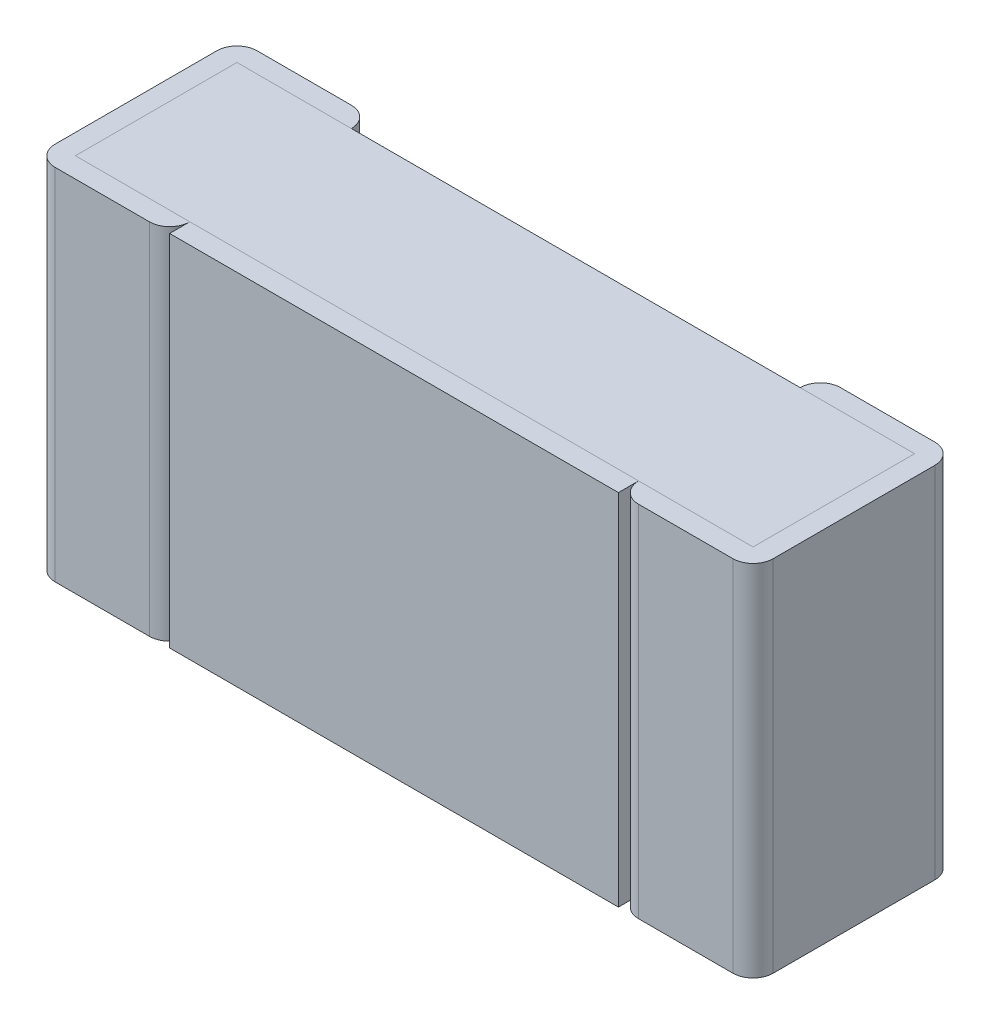
ISO-10303-21;
HEADER;
FILE_DESCRIPTION(('STEP AP214'),'2;1');
FILE_NAME('part.step','',(''),(''),'','','');
FILE_SCHEMA(('AUTOMOTIVE_DESIGN { 1 0 10303 214 1 1 1 1 }'));
ENDSEC;
DATA;
#1=APPLICATION_CONTEXT('core data for automotive mechanical design processes');
#2=APPLICATION_PROTOCOL_DEFINITION('international standard','automotive_design',2000,#1);
#3=PRODUCT_CONTEXT('',#1,'mechanical');
#4=PRODUCT('Part','Part','',(#3));
#5=PRODUCT_RELATED_PRODUCT_CATEGORY('part','',(#4));
#6=PRODUCT_DEFINITION_FORMATION('','',#4);
#7=PRODUCT_DEFINITION_CONTEXT('part definition',#1,'design');
#8=PRODUCT_DEFINITION('design','',#6,#7);
#9=PRODUCT_DEFINITION_SHAPE('','',#8);
#10=(LENGTH_UNIT() NAMED_UNIT(*) SI_UNIT(.MILLI.,.METRE.));
#11=(NAMED_UNIT(*) PLANE_ANGLE_UNIT() SI_UNIT($,.RADIAN.));
#12=(NAMED_UNIT(*) SI_UNIT($,.STERADIAN.) SOLID_ANGLE_UNIT());
#13=UNCERTAINTY_MEASURE_WITH_UNIT(LENGTH_MEASURE(1.E-05),#10,'distance_accuracy_value','');
#14=(GEOMETRIC_REPRESENTATION_CONTEXT(3) GLOBAL_UNCERTAINTY_ASSIGNED_CONTEXT((#13)) GLOBAL_UNIT_ASSIGNED_CONTEXT((#10,
#11,#12)) REPRESENTATION_CONTEXT('',''));
#15=CARTESIAN_POINT('',(0.,0.,0.));
#16=DIRECTION('',(0.,0.,1.));
#17=DIRECTION('',(1.,0.,0.));
#18=AXIS2_PLACEMENT_3D('',#15,#16,#17);
#19=CARTESIAN_POINT('',(144.520744279938,101.49204329235,142.661582908599));
#20=DIRECTION('',(0.,0.,1.));
#21=DIRECTION('',(1.,0.,0.));
#22=AXIS2_PLACEMENT_3D('',#19,#20,#21);
#23=PLANE('',#22);
#24=DIRECTION('',(0.,1.,0.));
#25=VECTOR('',#24,1.);
#26=CARTESIAN_POINT('',(144.520744279938,101.49204329235,142.661582908599));
#27=LINE('',#26,#25);
#28=CARTESIAN_POINT('',(144.520744279938,101.49204329235,142.661582908599));
#29=VERTEX_POINT('',#28);
#30=CARTESIAN_POINT('',(144.520744279938,102.29204329235,142.661582908599));
#31=VERTEX_POINT('',#30);
#32=EDGE_CURVE('E67',#29,#31,#27,.T.);
#33=ORIENTED_EDGE('',*,*,#32,.F.);
#34=DIRECTION('',(1.,0.,0.));
#35=VECTOR('',#34,1.);
#36=CARTESIAN_POINT('',(144.520744279938,101.49204329235,142.661582908599));
#37=LINE('',#36,#35);
#38=CARTESIAN_POINT('',(145.520744279938,101.49204329235,142.661582908599));
#39=VERTEX_POINT('',#38);
#40=EDGE_CURVE('E11',#29,#39,#37,.T.);
#41=ORIENTED_EDGE('',*,*,#40,.T.);
#42=DIRECTION('',(0.,1.,0.));
#43=VECTOR('',#42,1.);
#44=CARTESIAN_POINT('',(145.520744279938,101.49204329235,142.661582908599));
#45=LINE('',#44,#43);
#46=CARTESIAN_POINT('',(145.520744279938,102.29204329235,142.661582908599));
#47=VERTEX_POINT('',#46);
#48=EDGE_CURVE('E55',#39,#47,#45,.T.);
#49=ORIENTED_EDGE('',*,*,#48,.T.);
#50=DIRECTION('',(1.,0.,0.));
#51=VECTOR('',#50,1.);
#52=CARTESIAN_POINT('',(144.520744279938,102.29204329235,142.661582908599));
#53=LINE('',#52,#51);
#54=EDGE_CURVE('E399',#31,#47,#53,.T.);
#55=ORIENTED_EDGE('',*,*,#54,.F.);
#56=EDGE_LOOP('',(#33,#41,#49,#55));
#57=FACE_BOUND('',#56,.T.);
#58=ADVANCED_FACE('F44',(#57),#23,.T.);
#59=CARTESIAN_POINT('',(145.520744279938,101.49204329235,142.616582908599));
#60=DIRECTION('',(1.,0.,0.));
#61=DIRECTION('',(0.,1.,0.));
#62=AXIS2_PLACEMENT_3D('',#59,#60,#61);
#63=PLANE('',#62);
#64=DIRECTION('',(0.,0.,1.));
#65=VECTOR('',#64,1.);
#66=CARTESIAN_POINT('',(145.520744279938,101.49204329235,142.616582908599));
#67=LINE('',#66,#65);
#68=CARTESIAN_POINT('',(145.520744279938,101.49204329235,142.616582908599));
#69=VERTEX_POINT('',#68);
#70=EDGE_CURVE('E883',#69,#39,#67,.T.);
#71=ORIENTED_EDGE('',*,*,#70,.F.);
#72=DIRECTION('',(0.,1.,0.));
#73=VECTOR('',#72,1.);
#74=CARTESIAN_POINT('',(145.520744279938,101.49204329235,142.616582908599));
#75=LINE('',#74,#73);
#76=CARTESIAN_POINT('',(145.520744279938,102.29204329235,142.616582908599));
#77=VERTEX_POINT('',#76);
#78=EDGE_CURVE('E280',#69,#77,#75,.T.);
#79=ORIENTED_EDGE('',*,*,#78,.T.);
#80=DIRECTION('',(0.,0.,1.));
#81=VECTOR('',#80,1.);
#82=CARTESIAN_POINT('',(145.520744279938,102.29204329235,142.616582908599));
#83=LINE('',#82,#81);
#84=EDGE_CURVE('E276',#77,#47,#83,.T.);
#85=ORIENTED_EDGE('',*,*,#84,.T.);
#86=ORIENTED_EDGE('',*,*,#48,.F.);
#87=EDGE_LOOP('',(#71,#79,#85,#86));
#88=FACE_BOUND('',#87,.T.);
#89=ADVANCED_FACE('F46',(#88),#63,.T.);
#90=CARTESIAN_POINT('',(145.565744279938,101.49204329235,142.616582908599));
#91=DIRECTION('',(0.,1.,0.));
#92=DIRECTION('',(-1.,0.,0.));
#93=AXIS2_PLACEMENT_3D('',#90,#91,#92);
#94=CYLINDRICAL_SURFACE('',#93,0.0449999999999895);
#95=CARTESIAN_POINT('',(145.565744279938,101.49204329235,142.616582908599));
#96=DIRECTION('',(0.,1.,0.));
#97=DIRECTION('',(0.,0.,1.));
#98=AXIS2_PLACEMENT_3D('',#95,#96,#97);
#99=CIRCLE('',#98,0.0449999999999895);
#100=CARTESIAN_POINT('',(145.565744279938,101.49204329235,142.661582908599));
#101=VERTEX_POINT('',#100);
#102=EDGE_CURVE('E263',#69,#101,#99,.T.);
#103=ORIENTED_EDGE('',*,*,#102,.T.);
#104=DIRECTION('',(0.,1.,0.));
#105=VECTOR('',#104,1.);
#106=CARTESIAN_POINT('',(145.565744279938,101.49204329235,142.661582908599));
#107=LINE('',#106,#105);
#108=CARTESIAN_POINT('',(145.565744279938,102.29204329235,142.661582908599));
#109=VERTEX_POINT('',#108);
#110=EDGE_CURVE('E260',#101,#109,#107,.T.);
#111=ORIENTED_EDGE('',*,*,#110,.T.);
#112=CARTESIAN_POINT('',(145.565744279938,102.29204329235,142.616582908599));
#113=DIRECTION('',(0.,1.,0.));
#114=DIRECTION('',(0.,0.,1.));
#115=AXIS2_PLACEMENT_3D('',#112,#113,#114);
#116=CIRCLE('',#115,0.0449999999999895);
#117=EDGE_CURVE('E374',#77,#109,#116,.T.);
#118=ORIENTED_EDGE('',*,*,#117,.F.);
#119=ORIENTED_EDGE('',*,*,#78,.F.);
#120=EDGE_LOOP('',(#103,#111,#118,#119));
#121=FACE_BOUND('',#120,.T.);
#122=ADVANCED_FACE('F493',(#121),#94,.T.);
#123=CARTESIAN_POINT('',(145.520744279938,101.49204329235,142.661582908599));
#124=DIRECTION('',(0.,0.,1.));
#125=DIRECTION('',(1.,0.,0.));
#126=AXIS2_PLACEMENT_3D('',#123,#124,#125);
#127=PLANE('',#126);
#128=DIRECTION('',(1.,0.,0.));
#129=VECTOR('',#128,1.);
#130=CARTESIAN_POINT('',(145.520744279938,102.29204329235,142.661582908599));
#131=LINE('',#130,#129);
#132=CARTESIAN_POINT('',(145.775744279938,102.29204329235,142.661582908599));
#133=VERTEX_POINT('',#132);
#134=EDGE_CURVE('E878',#109,#133,#131,.T.);
#135=ORIENTED_EDGE('',*,*,#134,.F.);
#136=ORIENTED_EDGE('',*,*,#110,.F.);
#137=DIRECTION('',(1.,0.,0.));
#138=VECTOR('',#137,1.);
#139=CARTESIAN_POINT('',(145.520744279938,101.49204329235,142.661582908599));
#140=LINE('',#139,#138);
#141=CARTESIAN_POINT('',(145.775744279938,101.49204329235,142.661582908599));
#142=VERTEX_POINT('',#141);
#143=EDGE_CURVE('E264',#101,#142,#140,.T.);
#144=ORIENTED_EDGE('',*,*,#143,.T.);
#145=DIRECTION('',(0.,1.,0.));
#146=VECTOR('',#145,1.);
#147=CARTESIAN_POINT('',(145.775744279938,101.49204329235,142.661582908599));
#148=LINE('',#147,#146);
#149=EDGE_CURVE('E313',#142,#133,#148,.T.);
#150=ORIENTED_EDGE('',*,*,#149,.T.);
#151=EDGE_LOOP('',(#135,#136,#144,#150));
#152=FACE_BOUND('',#151,.T.);
#153=ADVANCED_FACE('F524',(#152),#127,.T.);
#154=CARTESIAN_POINT('',(145.775744279938,101.49204329235,142.616582908599));
#155=DIRECTION('',(0.,1.,0.));
#156=DIRECTION('',(1.,0.,0.));
#157=AXIS2_PLACEMENT_3D('',#154,#155,#156);
#158=CYLINDRICAL_SURFACE('',#157,0.0449999999999895);
#159=DIRECTION('',(0.,1.,0.));
#160=VECTOR('',#159,1.);
#161=CARTESIAN_POINT('',(145.820744279938,101.49204329235,142.616582908599));
#162=LINE('',#161,#160);
#163=CARTESIAN_POINT('',(145.820744279938,101.49204329235,142.616582908599));
#164=VERTEX_POINT('',#163);
#165=CARTESIAN_POINT('',(145.820744279938,102.29204329235,142.616582908599));
#166=VERTEX_POINT('',#165);
#167=EDGE_CURVE('E317',#164,#166,#162,.T.);
#168=ORIENTED_EDGE('',*,*,#167,.T.);
#169=CARTESIAN_POINT('',(145.775744279938,102.29204329235,142.616582908599));
#170=DIRECTION('',(0.,-1.,0.));
#171=DIRECTION('',(0.,0.,1.));
#172=AXIS2_PLACEMENT_3D('',#169,#170,#171);
#173=CIRCLE('',#172,0.0449999999999895);
#174=EDGE_CURVE('E308',#166,#133,#173,.T.);
#175=ORIENTED_EDGE('',*,*,#174,.T.);
#176=ORIENTED_EDGE('',*,*,#149,.F.);
#177=CARTESIAN_POINT('',(145.775744279938,101.49204329235,142.616582908599));
#178=DIRECTION('',(0.,-1.,0.));
#179=DIRECTION('',(0.,0.,1.));
#180=AXIS2_PLACEMENT_3D('',#177,#178,#179);
#181=CIRCLE('',#180,0.0449999999999895);
#182=EDGE_CURVE('E327',#164,#142,#181,.T.);
#183=ORIENTED_EDGE('',*,*,#182,.F.);
#184=EDGE_LOOP('',(#168,#175,#176,#183));
#185=FACE_BOUND('',#184,.T.);
#186=ADVANCED_FACE('F512',(#185),#158,.T.);
#187=CARTESIAN_POINT('',(145.820744279938,101.49204329235,142.211582908599));
#188=DIRECTION('',(1.,0.,0.));
#189=DIRECTION('',(0.,1.,0.));
#190=AXIS2_PLACEMENT_3D('',#187,#188,#189);
#191=PLANE('',#190);
#192=DIRECTION('',(0.,0.,1.));
#193=VECTOR('',#192,1.);
#194=CARTESIAN_POINT('',(145.820744279938,101.49204329235,142.211582908599));
#195=LINE('',#194,#193);
#196=CARTESIAN_POINT('',(145.820744279938,101.49204329235,142.256582908599));
#197=VERTEX_POINT('',#196);
#198=EDGE_CURVE('E448',#197,#164,#195,.T.);
#199=ORIENTED_EDGE('',*,*,#198,.F.);
#200=DIRECTION('',(0.,1.,0.));
#201=VECTOR('',#200,1.);
#202=CARTESIAN_POINT('',(145.820744279938,101.49204329235,142.256582908599));
#203=LINE('',#202,#201);
#204=CARTESIAN_POINT('',(145.820744279938,102.29204329235,142.256582908599));
#205=VERTEX_POINT('',#204);
#206=EDGE_CURVE('E304',#197,#205,#203,.T.);
#207=ORIENTED_EDGE('',*,*,#206,.T.);
#208=DIRECTION('',(0.,0.,1.));
#209=VECTOR('',#208,1.);
#210=CARTESIAN_POINT('',(145.820744279938,102.29204329235,142.211582908599));
#211=LINE('',#210,#209);
#212=EDGE_CURVE('E309',#205,#166,#211,.T.);
#213=ORIENTED_EDGE('',*,*,#212,.T.);
#214=ORIENTED_EDGE('',*,*,#167,.F.);
#215=EDGE_LOOP('',(#199,#207,#213,#214));
#216=FACE_BOUND('',#215,.T.);
#217=ADVANCED_FACE('F508',(#216),#191,.T.);
#218=CARTESIAN_POINT('',(145.775744279938,101.49204329235,142.256582908599));
#219=DIRECTION('',(0.,1.,0.));
#220=DIRECTION('',(1.,0.,0.));
#221=AXIS2_PLACEMENT_3D('',#218,#219,#220);
#222=CYLINDRICAL_SURFACE('',#221,0.0449999999999895);
#223=CARTESIAN_POINT('',(145.775744279938,101.49204329235,142.256582908599));
#224=DIRECTION('',(0.,1.,0.));
#225=DIRECTION('',(0.,0.,1.));
#226=AXIS2_PLACEMENT_3D('',#223,#224,#225);
#227=CIRCLE('',#226,0.0449999999999895);
#228=CARTESIAN_POINT('',(145.775744279938,101.49204329235,142.211582908599));
#229=VERTEX_POINT('',#228);
#230=EDGE_CURVE('E358',#197,#229,#227,.T.);
#231=ORIENTED_EDGE('',*,*,#230,.T.);
#232=DIRECTION('',(0.,1.,0.));
#233=VECTOR('',#232,1.);
#234=CARTESIAN_POINT('',(145.775744279938,101.49204329235,142.211582908599));
#235=LINE('',#234,#233);
#236=CARTESIAN_POINT('',(145.775744279938,102.29204329235,142.211582908599));
#237=VERTEX_POINT('',#236);
#238=EDGE_CURVE('E355',#229,#237,#235,.T.);
#239=ORIENTED_EDGE('',*,*,#238,.T.);
#240=CARTESIAN_POINT('',(145.775744279938,102.29204329235,142.256582908599));
#241=DIRECTION('',(0.,1.,0.));
#242=DIRECTION('',(0.,0.,1.));
#243=AXIS2_PLACEMENT_3D('',#240,#241,#242);
#244=CIRCLE('',#243,0.0449999999999895);
#245=EDGE_CURVE('E383',#205,#237,#244,.T.);
#246=ORIENTED_EDGE('',*,*,#245,.F.);
#247=ORIENTED_EDGE('',*,*,#206,.F.);
#248=EDGE_LOOP('',(#231,#239,#246,#247));
#249=FACE_BOUND('',#248,.T.);
#250=ADVANCED_FACE('F511',(#249),#222,.T.);
#251=CARTESIAN_POINT('',(145.520744279938,101.49204329235,142.211582908599));
#252=DIRECTION('',(0.,0.,1.));
#253=DIRECTION('',(1.,0.,0.));
#254=AXIS2_PLACEMENT_3D('',#251,#252,#253);
#255=PLANE('',#254);
#256=ORIENTED_EDGE('',*,*,#238,.F.);
#257=DIRECTION('',(1.,0.,0.));
#258=VECTOR('',#257,1.);
#259=CARTESIAN_POINT('',(145.520744279938,101.49204329235,142.211582908599));
#260=LINE('',#259,#258);
#261=CARTESIAN_POINT('',(145.565744279938,101.49204329235,142.211582908599));
#262=VERTEX_POINT('',#261);
#263=EDGE_CURVE('E258',#262,#229,#260,.T.);
#264=ORIENTED_EDGE('',*,*,#263,.F.);
#265=DIRECTION('',(0.,1.,0.));
#266=VECTOR('',#265,1.);
#267=CARTESIAN_POINT('',(145.565744279938,101.49204329235,142.211582908599));
#268=LINE('',#267,#266);
#269=CARTESIAN_POINT('',(145.565744279938,102.29204329235,142.211582908599));
#270=VERTEX_POINT('',#269);
#271=EDGE_CURVE('E359',#262,#270,#268,.T.);
#272=ORIENTED_EDGE('',*,*,#271,.T.);
#273=DIRECTION('',(1.,0.,0.));
#274=VECTOR('',#273,1.);
#275=CARTESIAN_POINT('',(145.520744279938,102.29204329235,142.211582908599));
#276=LINE('',#275,#274);
#277=EDGE_CURVE('E417',#270,#237,#276,.T.);
#278=ORIENTED_EDGE('',*,*,#277,.T.);
#279=EDGE_LOOP('',(#256,#264,#272,#278));
#280=FACE_BOUND('',#279,.T.);
#281=ADVANCED_FACE('F534',(#280),#255,.F.);
#282=CARTESIAN_POINT('',(145.565744279938,101.49204329235,142.256582908599));
#283=DIRECTION('',(0.,1.,0.));
#284=DIRECTION('',(-1.,0.,0.));
#285=AXIS2_PLACEMENT_3D('',#282,#283,#284);
#286=CYLINDRICAL_SURFACE('',#285,0.0449999999999895);
#287=DIRECTION('',(0.,1.,0.));
#288=VECTOR('',#287,1.);
#289=CARTESIAN_POINT('',(145.520744279938,101.49204329235,142.256582908599));
#290=LINE('',#289,#288);
#291=CARTESIAN_POINT('',(145.520744279938,101.49204329235,142.256582908599));
#292=VERTEX_POINT('',#291);
#293=CARTESIAN_POINT('',(145.520744279938,102.29204329235,142.256582908599));
#294=VERTEX_POINT('',#293);
#295=EDGE_CURVE('E412',#292,#294,#290,.T.);
#296=ORIENTED_EDGE('',*,*,#295,.T.);
#297=CARTESIAN_POINT('',(145.565744279938,102.29204329235,142.256582908599));
#298=DIRECTION('',(0.,-1.,0.));
#299=DIRECTION('',(0.,0.,1.));
#300=AXIS2_PLACEMENT_3D('',#297,#298,#299);
#301=CIRCLE('',#300,0.0449999999999895);
#302=EDGE_CURVE('E408',#294,#270,#301,.T.);
#303=ORIENTED_EDGE('',*,*,#302,.T.);
#304=ORIENTED_EDGE('',*,*,#271,.F.);
#305=CARTESIAN_POINT('',(145.565744279938,101.49204329235,142.256582908599));
#306=DIRECTION('',(0.,-1.,0.));
#307=DIRECTION('',(0.,0.,1.));
#308=AXIS2_PLACEMENT_3D('',#305,#306,#307);
#309=CIRCLE('',#308,0.0449999999999895);
#310=EDGE_CURVE('E328',#292,#262,#309,.T.);
#311=ORIENTED_EDGE('',*,*,#310,.F.);
#312=EDGE_LOOP('',(#296,#303,#304,#311));
#313=FACE_BOUND('',#312,.T.);
#314=ADVANCED_FACE('F496',(#313),#286,.T.);
#315=CARTESIAN_POINT('',(144.520744279938,102.29204329235,142.616582908599));
#316=DIRECTION('',(0.,1.,0.));
#317=DIRECTION('',(1.,0.,0.));
#318=AXIS2_PLACEMENT_3D('',#315,#316,#317);
#319=PLANE('',#318);
#320=DIRECTION('',(1.,0.,0.));
#321=VECTOR('',#320,1.);
#322=CARTESIAN_POINT('',(144.520744279938,102.29204329235,142.616582908599));
#323=LINE('',#322,#321);
#324=CARTESIAN_POINT('',(144.520744279938,102.29204329235,142.616582908599));
#325=VERTEX_POINT('',#324);
#326=EDGE_CURVE('E284',#325,#77,#323,.T.);
#327=ORIENTED_EDGE('',*,*,#326,.F.);
#328=DIRECTION('',(0.,0.,1.));
#329=VECTOR('',#328,1.);
#330=CARTESIAN_POINT('',(144.520744279938,102.29204329235,142.616582908599));
#331=LINE('',#330,#329);
#332=EDGE_CURVE('E413',#325,#31,#331,.T.);
#333=ORIENTED_EDGE('',*,*,#332,.T.);
#334=ORIENTED_EDGE('',*,*,#54,.T.);
#335=ORIENTED_EDGE('',*,*,#84,.F.);
#336=EDGE_LOOP('',(#327,#333,#334,#335));
#337=FACE_BOUND('',#336,.T.);
#338=ADVANCED_FACE('F502',(#337),#319,.T.);
#339=CARTESIAN_POINT('',(145.520744279938,102.29204329235,142.211582908599));
#340=DIRECTION('',(0.,1.,0.));
#341=DIRECTION('',(1.,0.,0.));
#342=AXIS2_PLACEMENT_3D('',#339,#340,#341);
#343=PLANE('',#342);
#344=ORIENTED_EDGE('',*,*,#277,.F.);
#345=ORIENTED_EDGE('',*,*,#302,.F.);
#346=DIRECTION('',(1.,0.,0.));
#347=VECTOR('',#346,1.);
#348=CARTESIAN_POINT('',(144.265744279938,102.29204329235,142.256582908599));
#349=LINE('',#348,#347);
#350=CARTESIAN_POINT('',(145.775744279938,102.29204329235,142.256582908599));
#351=VERTEX_POINT('',#350);
#352=EDGE_CURVE('E373',#294,#351,#349,.T.);
#353=ORIENTED_EDGE('',*,*,#352,.T.);
#354=DIRECTION('',(0.,0.,1.));
#355=VECTOR('',#354,1.);
#356=CARTESIAN_POINT('',(145.775744279938,102.29204329235,142.256582908599));
#357=LINE('',#356,#355);
#358=CARTESIAN_POINT('',(145.775744279938,102.29204329235,142.616582908599));
#359=VERTEX_POINT('',#358);
#360=EDGE_CURVE('E369',#351,#359,#357,.T.);
#361=ORIENTED_EDGE('',*,*,#360,.T.);
#362=DIRECTION('',(1.,0.,0.));
#363=VECTOR('',#362,1.);
#364=CARTESIAN_POINT('',(144.265744279938,102.29204329235,142.616582908599));
#365=LINE('',#364,#363);
#366=EDGE_CURVE('E268',#77,#359,#365,.T.);
#367=ORIENTED_EDGE('',*,*,#366,.F.);
#368=ORIENTED_EDGE('',*,*,#117,.T.);
#369=ORIENTED_EDGE('',*,*,#134,.T.);
#370=ORIENTED_EDGE('',*,*,#174,.F.);
#371=ORIENTED_EDGE('',*,*,#212,.F.);
#372=ORIENTED_EDGE('',*,*,#245,.T.);
#373=EDGE_LOOP('',(#344,#345,#353,#361,#367,#368,#369,#370,#371,#372));
#374=FACE_BOUND('',#373,.T.);
#375=ADVANCED_FACE('F498',(#374),#343,.T.);
#376=CARTESIAN_POINT('',(144.520744279938,101.49204329235,142.616582908599));
#377=DIRECTION('',(1.,0.,0.));
#378=DIRECTION('',(0.,1.,0.));
#379=AXIS2_PLACEMENT_3D('',#376,#377,#378);
#380=PLANE('',#379);
#381=ORIENTED_EDGE('',*,*,#32,.T.);
#382=ORIENTED_EDGE('',*,*,#332,.F.);
#383=DIRECTION('',(0.,1.,0.));
#384=VECTOR('',#383,1.);
#385=CARTESIAN_POINT('',(144.520744279938,101.49204329235,142.616582908599));
#386=LINE('',#385,#384);
#387=CARTESIAN_POINT('',(144.520744279938,101.49204329235,142.616582908599));
#388=VERTEX_POINT('',#387);
#389=EDGE_CURVE('E265',#388,#325,#386,.T.);
#390=ORIENTED_EDGE('',*,*,#389,.F.);
#391=DIRECTION('',(0.,0.,1.));
#392=VECTOR('',#391,1.);
#393=CARTESIAN_POINT('',(144.520744279938,101.49204329235,142.616582908599));
#394=LINE('',#393,#392);
#395=EDGE_CURVE('E384',#388,#29,#394,.T.);
#396=ORIENTED_EDGE('',*,*,#395,.T.);
#397=EDGE_LOOP('',(#381,#382,#390,#396));
#398=FACE_BOUND('',#397,.T.);
#399=ADVANCED_FACE('F501',(#398),#380,.F.);
#400=CARTESIAN_POINT('',(144.520744279938,101.49204329235,142.616582908599));
#401=DIRECTION('',(0.,1.,0.));
#402=DIRECTION('',(1.,0.,0.));
#403=AXIS2_PLACEMENT_3D('',#400,#401,#402);
#404=PLANE('',#403);
#405=ORIENTED_EDGE('',*,*,#70,.T.);
#406=ORIENTED_EDGE('',*,*,#40,.F.);
#407=ORIENTED_EDGE('',*,*,#395,.F.);
#408=DIRECTION('',(1.,0.,0.));
#409=VECTOR('',#408,1.);
#410=CARTESIAN_POINT('',(144.520744279938,101.49204329235,142.616582908599));
#411=LINE('',#410,#409);
#412=EDGE_CURVE('E452',#388,#69,#411,.T.);
#413=ORIENTED_EDGE('',*,*,#412,.T.);
#414=EDGE_LOOP('',(#405,#406,#407,#413));
#415=FACE_BOUND('',#414,.T.);
#416=ADVANCED_FACE('F514',(#415),#404,.F.);
#417=CARTESIAN_POINT('',(145.520744279938,101.49204329235,142.211582908599));
#418=DIRECTION('',(0.,1.,0.));
#419=DIRECTION('',(1.,0.,0.));
#420=AXIS2_PLACEMENT_3D('',#417,#418,#419);
#421=PLANE('',#420);
#422=ORIENTED_EDGE('',*,*,#230,.F.);
#423=ORIENTED_EDGE('',*,*,#198,.T.);
#424=ORIENTED_EDGE('',*,*,#182,.T.);
#425=ORIENTED_EDGE('',*,*,#143,.F.);
#426=ORIENTED_EDGE('',*,*,#102,.F.);
#427=DIRECTION('',(1.,0.,0.));
#428=VECTOR('',#427,1.);
#429=CARTESIAN_POINT('',(144.265744279938,101.49204329235,142.616582908599));
#430=LINE('',#429,#428);
#431=CARTESIAN_POINT('',(145.775744279938,101.49204329235,142.616582908599));
#432=VERTEX_POINT('',#431);
#433=EDGE_CURVE('E323',#69,#432,#430,.T.);
#434=ORIENTED_EDGE('',*,*,#433,.T.);
#435=DIRECTION('',(0.,0.,1.));
#436=VECTOR('',#435,1.);
#437=CARTESIAN_POINT('',(145.775744279938,101.49204329235,142.256582908599));
#438=LINE('',#437,#436);
#439=CARTESIAN_POINT('',(145.775744279938,101.49204329235,142.256582908599));
#440=VERTEX_POINT('',#439);
#441=EDGE_CURVE('E244',#440,#432,#438,.T.);
#442=ORIENTED_EDGE('',*,*,#441,.F.);
#443=DIRECTION('',(1.,0.,0.));
#444=VECTOR('',#443,1.);
#445=CARTESIAN_POINT('',(144.265744279938,101.49204329235,142.256582908599));
#446=LINE('',#445,#444);
#447=EDGE_CURVE('E251',#292,#440,#446,.T.);
#448=ORIENTED_EDGE('',*,*,#447,.F.);
#449=ORIENTED_EDGE('',*,*,#310,.T.);
#450=ORIENTED_EDGE('',*,*,#263,.T.);
#451=EDGE_LOOP('',(#422,#423,#424,#425,#426,#434,#442,#448,#449,#450));
#452=FACE_BOUND('',#451,.T.);
#453=ADVANCED_FACE('F517',(#452),#421,.F.);
#454=CARTESIAN_POINT('',(144.265744279938,101.49204329235,142.256582908599));
#455=DIRECTION('',(0.,0.,1.));
#456=DIRECTION('',(1.,0.,0.));
#457=AXIS2_PLACEMENT_3D('',#454,#455,#456);
#458=PLANE('',#457);
#459=DIRECTION('',(1.,0.,0.));
#460=VECTOR('',#459,1.);
#461=CARTESIAN_POINT('',(144.265744279938,102.29204329235,142.256582908599));
#462=LINE('',#461,#460);
#463=CARTESIAN_POINT('',(144.520744279938,102.29204329235,142.256582908599));
#464=VERTEX_POINT('',#463);
#465=EDGE_CURVE('E274',#464,#294,#462,.T.);
#466=ORIENTED_EDGE('',*,*,#465,.T.);
#467=ORIENTED_EDGE('',*,*,#295,.F.);
#468=DIRECTION('',(1.,0.,0.));
#469=VECTOR('',#468,1.);
#470=CARTESIAN_POINT('',(144.265744279938,101.49204329235,142.256582908599));
#471=LINE('',#470,#469);
#472=CARTESIAN_POINT('',(144.520744279938,101.49204329235,142.256582908599));
#473=VERTEX_POINT('',#472);
#474=EDGE_CURVE('E293',#473,#292,#471,.T.);
#475=ORIENTED_EDGE('',*,*,#474,.F.);
#476=DIRECTION('',(0.,1.,0.));
#477=VECTOR('',#476,1.);
#478=CARTESIAN_POINT('',(144.520744279938,101.49204329235,142.256582908599));
#479=LINE('',#478,#477);
#480=EDGE_CURVE('E270',#473,#464,#479,.T.);
#481=ORIENTED_EDGE('',*,*,#480,.T.);
#482=EDGE_LOOP('',(#466,#467,#475,#481));
#483=FACE_BOUND('',#482,.T.);
#484=ADVANCED_FACE('F470',(#483),#458,.F.);
#485=CARTESIAN_POINT('',(144.265744279938,102.29204329235,142.256582908599));
#486=DIRECTION('',(0.,1.,0.));
#487=DIRECTION('',(1.,0.,0.));
#488=AXIS2_PLACEMENT_3D('',#485,#486,#487);
#489=PLANE('',#488);
#490=DIRECTION('',(1.,0.,0.));
#491=VECTOR('',#490,1.);
#492=CARTESIAN_POINT('',(144.265744279938,102.29204329235,142.256582908599));
#493=LINE('',#492,#491);
#494=CARTESIAN_POINT('',(144.265744279938,102.29204329235,142.256582908599));
#495=VERTEX_POINT('',#494);
#496=EDGE_CURVE('E48',#495,#464,#493,.T.);
#497=ORIENTED_EDGE('',*,*,#496,.F.);
#498=DIRECTION('',(0.,0.,1.));
#499=VECTOR('',#498,1.);
#500=CARTESIAN_POINT('',(144.265744279938,102.29204329235,142.256582908599));
#501=LINE('',#500,#499);
#502=CARTESIAN_POINT('',(144.265744279938,102.29204329235,142.616582908599));
#503=VERTEX_POINT('',#502);
#504=EDGE_CURVE('E275',#495,#503,#501,.T.);
#505=ORIENTED_EDGE('',*,*,#504,.T.);
#506=DIRECTION('',(1.,0.,0.));
#507=VECTOR('',#506,1.);
#508=CARTESIAN_POINT('',(144.265744279938,102.29204329235,142.616582908599));
#509=LINE('',#508,#507);
#510=EDGE_CURVE('E361',#503,#325,#509,.T.);
#511=ORIENTED_EDGE('',*,*,#510,.T.);
#512=ORIENTED_EDGE('',*,*,#326,.T.);
#513=ORIENTED_EDGE('',*,*,#366,.T.);
#514=ORIENTED_EDGE('',*,*,#360,.F.);
#515=ORIENTED_EDGE('',*,*,#352,.F.);
#516=ORIENTED_EDGE('',*,*,#465,.F.);
#517=EDGE_LOOP('',(#497,#505,#511,#512,#513,#514,#515,#516));
#518=FACE_BOUND('',#517,.T.);
#519=ADVANCED_FACE('F473',(#518),#489,.T.);
#520=CARTESIAN_POINT('',(144.475744279938,101.49204329235,142.616582908599));
#521=DIRECTION('',(0.,1.,0.));
#522=DIRECTION('',(1.,0.,0.));
#523=AXIS2_PLACEMENT_3D('',#520,#521,#522);
#524=CYLINDRICAL_SURFACE('',#523,0.0449999999999895);
#525=ORIENTED_EDGE('',*,*,#389,.T.);
#526=CARTESIAN_POINT('',(144.475744279938,102.29204329235,142.616582908599));
#527=DIRECTION('',(0.,-1.,0.));
#528=DIRECTION('',(0.,0.,1.));
#529=AXIS2_PLACEMENT_3D('',#526,#527,#528);
#530=CIRCLE('',#529,0.0449999999999895);
#531=CARTESIAN_POINT('',(144.475744279938,102.29204329235,142.661582908599));
#532=VERTEX_POINT('',#531);
#533=EDGE_CURVE('E269',#325,#532,#530,.T.);
#534=ORIENTED_EDGE('',*,*,#533,.T.);
#535=DIRECTION('',(0.,1.,0.));
#536=VECTOR('',#535,1.);
#537=CARTESIAN_POINT('',(144.475744279938,101.49204329235,142.661582908599));
#538=LINE('',#537,#536);
#539=CARTESIAN_POINT('',(144.475744279938,101.49204329235,142.661582908599));
#540=VERTEX_POINT('',#539);
#541=EDGE_CURVE('E332',#540,#532,#538,.T.);
#542=ORIENTED_EDGE('',*,*,#541,.F.);
#543=CARTESIAN_POINT('',(144.475744279938,101.49204329235,142.616582908599));
#544=DIRECTION('',(0.,-1.,0.));
#545=DIRECTION('',(0.,0.,1.));
#546=AXIS2_PLACEMENT_3D('',#543,#544,#545);
#547=CIRCLE('',#546,0.0449999999999895);
#548=EDGE_CURVE('E393',#388,#540,#547,.T.);
#549=ORIENTED_EDGE('',*,*,#548,.F.);
#550=EDGE_LOOP('',(#525,#534,#542,#549));
#551=FACE_BOUND('',#550,.T.);
#552=ADVANCED_FACE('F506',(#551),#524,.T.);
#553=CARTESIAN_POINT('',(144.220744279938,101.49204329235,142.661582908599));
#554=DIRECTION('',(0.,0.,1.));
#555=DIRECTION('',(1.,0.,0.));
#556=AXIS2_PLACEMENT_3D('',#553,#554,#555);
#557=PLANE('',#556);
#558=DIRECTION('',(1.,0.,0.));
#559=VECTOR('',#558,1.);
#560=CARTESIAN_POINT('',(144.220744279938,102.29204329235,142.661582908599));
#561=LINE('',#560,#559);
#562=CARTESIAN_POINT('',(144.265744279938,102.29204329235,142.661582908599));
#563=VERTEX_POINT('',#562);
#564=EDGE_CURVE('E318',#563,#532,#561,.T.);
#565=ORIENTED_EDGE('',*,*,#564,.F.);
#566=DIRECTION('',(0.,1.,0.));
#567=VECTOR('',#566,1.);
#568=CARTESIAN_POINT('',(144.265744279938,101.49204329235,142.661582908599));
#569=LINE('',#568,#567);
#570=CARTESIAN_POINT('',(144.265744279938,101.49204329235,142.661582908599));
#571=VERTEX_POINT('',#570);
#572=EDGE_CURVE('E285',#571,#563,#569,.T.);
#573=ORIENTED_EDGE('',*,*,#572,.F.);
#574=DIRECTION('',(1.,0.,0.));
#575=VECTOR('',#574,1.);
#576=CARTESIAN_POINT('',(144.220744279938,101.49204329235,142.661582908599));
#577=LINE('',#576,#575);
#578=EDGE_CURVE('E329',#571,#540,#577,.T.);
#579=ORIENTED_EDGE('',*,*,#578,.T.);
#580=ORIENTED_EDGE('',*,*,#541,.T.);
#581=EDGE_LOOP('',(#565,#573,#579,#580));
#582=FACE_BOUND('',#581,.T.);
#583=ADVANCED_FACE('F485',(#582),#557,.T.);
#584=CARTESIAN_POINT('',(144.265744279938,101.49204329235,142.256582908599));
#585=DIRECTION('',(0.,1.,0.));
#586=DIRECTION('',(1.,0.,0.));
#587=AXIS2_PLACEMENT_3D('',#584,#585,#586);
#588=PLANE('',#587);
#589=ORIENTED_EDGE('',*,*,#474,.T.);
#590=ORIENTED_EDGE('',*,*,#447,.T.);
#591=ORIENTED_EDGE('',*,*,#441,.T.);
#592=ORIENTED_EDGE('',*,*,#433,.F.);
#593=ORIENTED_EDGE('',*,*,#412,.F.);
#594=DIRECTION('',(1.,0.,0.));
#595=VECTOR('',#594,1.);
#596=CARTESIAN_POINT('',(144.265744279938,101.49204329235,142.616582908599));
#597=LINE('',#596,#595);
#598=CARTESIAN_POINT('',(144.265744279938,101.49204329235,142.616582908599));
#599=VERTEX_POINT('',#598);
#600=EDGE_CURVE('E234',#599,#388,#597,.T.);
#601=ORIENTED_EDGE('',*,*,#600,.F.);
#602=DIRECTION('',(0.,0.,1.));
#603=VECTOR('',#602,1.);
#604=CARTESIAN_POINT('',(144.265744279938,101.49204329235,142.256582908599));
#605=LINE('',#604,#603);
#606=CARTESIAN_POINT('',(144.265744279938,101.49204329235,142.256582908599));
#607=VERTEX_POINT('',#606);
#608=EDGE_CURVE('E226',#607,#599,#605,.T.);
#609=ORIENTED_EDGE('',*,*,#608,.F.);
#610=DIRECTION('',(1.,0.,0.));
#611=VECTOR('',#610,1.);
#612=CARTESIAN_POINT('',(144.265744279938,101.49204329235,142.256582908599));
#613=LINE('',#612,#611);
#614=EDGE_CURVE('E230',#607,#473,#613,.T.);
#615=ORIENTED_EDGE('',*,*,#614,.T.);
#616=EDGE_LOOP('',(#589,#590,#591,#592,#593,#601,#609,#615));
#617=FACE_BOUND('',#616,.T.);
#618=ADVANCED_FACE('F229',(#617),#588,.F.);
#619=CARTESIAN_POINT('',(144.475744279938,101.49204329235,142.256582908599));
#620=DIRECTION('',(0.,1.,0.));
#621=DIRECTION('',(1.,0.,0.));
#622=AXIS2_PLACEMENT_3D('',#619,#620,#621);
#623=CYLINDRICAL_SURFACE('',#622,0.0449999999999895);
#624=CARTESIAN_POINT('',(144.475744279938,101.49204329235,142.256582908599));
#625=DIRECTION('',(0.,1.,0.));
#626=DIRECTION('',(0.,0.,1.));
#627=AXIS2_PLACEMENT_3D('',#624,#625,#626);
#628=CIRCLE('',#627,0.0449999999999895);
#629=CARTESIAN_POINT('',(144.475744279938,101.49204329235,142.211582908599));
#630=VERTEX_POINT('',#629);
#631=EDGE_CURVE('E242',#473,#630,#628,.T.);
#632=ORIENTED_EDGE('',*,*,#631,.T.);
#633=DIRECTION('',(0.,1.,0.));
#634=VECTOR('',#633,1.);
#635=CARTESIAN_POINT('',(144.475744279938,101.49204329235,142.211582908599));
#636=LINE('',#635,#634);
#637=CARTESIAN_POINT('',(144.475744279938,102.29204329235,142.211582908599));
#638=VERTEX_POINT('',#637);
#639=EDGE_CURVE('E254',#630,#638,#636,.T.);
#640=ORIENTED_EDGE('',*,*,#639,.T.);
#641=CARTESIAN_POINT('',(144.475744279938,102.29204329235,142.256582908599));
#642=DIRECTION('',(0.,1.,0.));
#643=DIRECTION('',(0.,0.,1.));
#644=AXIS2_PLACEMENT_3D('',#641,#642,#643);
#645=CIRCLE('',#644,0.0449999999999895);
#646=EDGE_CURVE('E172',#464,#638,#645,.T.);
#647=ORIENTED_EDGE('',*,*,#646,.F.);
#648=ORIENTED_EDGE('',*,*,#480,.F.);
#649=EDGE_LOOP('',(#632,#640,#647,#648));
#650=FACE_BOUND('',#649,.T.);
#651=ADVANCED_FACE('F476',(#650),#623,.T.);
#652=CARTESIAN_POINT('',(144.220744279938,101.49204329235,142.211582908599));
#653=DIRECTION('',(0.,0.,1.));
#654=DIRECTION('',(1.,0.,0.));
#655=AXIS2_PLACEMENT_3D('',#652,#653,#654);
#656=PLANE('',#655);
#657=ORIENTED_EDGE('',*,*,#639,.F.);
#658=DIRECTION('',(1.,0.,0.));
#659=VECTOR('',#658,1.);
#660=CARTESIAN_POINT('',(144.220744279938,101.49204329235,142.211582908599));
#661=LINE('',#660,#659);
#662=CARTESIAN_POINT('',(144.265744279938,101.49204329235,142.211582908599));
#663=VERTEX_POINT('',#662);
#664=EDGE_CURVE('E184',#663,#630,#661,.T.);
#665=ORIENTED_EDGE('',*,*,#664,.F.);
#666=DIRECTION('',(0.,1.,0.));
#667=VECTOR('',#666,1.);
#668=CARTESIAN_POINT('',(144.265744279938,101.49204329235,142.211582908599));
#669=LINE('',#668,#667);
#670=CARTESIAN_POINT('',(144.265744279938,102.29204329235,142.211582908599));
#671=VERTEX_POINT('',#670);
#672=EDGE_CURVE('E334',#663,#671,#669,.T.);
#673=ORIENTED_EDGE('',*,*,#672,.T.);
#674=DIRECTION('',(1.,0.,0.));
#675=VECTOR('',#674,1.);
#676=CARTESIAN_POINT('',(144.220744279938,102.29204329235,142.211582908599));
#677=LINE('',#676,#675);
#678=EDGE_CURVE('E340',#671,#638,#677,.T.);
#679=ORIENTED_EDGE('',*,*,#678,.T.);
#680=EDGE_LOOP('',(#657,#665,#673,#679));
#681=FACE_BOUND('',#680,.T.);
#682=ADVANCED_FACE('F478',(#681),#656,.F.);
#683=CARTESIAN_POINT('',(144.220744279938,102.29204329235,142.211582908599));
#684=DIRECTION('',(0.,1.,0.));
#685=DIRECTION('',(1.,0.,0.));
#686=AXIS2_PLACEMENT_3D('',#683,#684,#685);
#687=PLANE('',#686);
#688=ORIENTED_EDGE('',*,*,#678,.F.);
#689=CARTESIAN_POINT('',(144.265744279938,102.29204329235,142.256582908599));
#690=DIRECTION('',(0.,-1.,0.));
#691=DIRECTION('',(0.,0.,1.));
#692=AXIS2_PLACEMENT_3D('',#689,#690,#691);
#693=CIRCLE('',#692,0.0449999999999895);
#694=CARTESIAN_POINT('',(144.220744279938,102.29204329235,142.256582908599));
#695=VERTEX_POINT('',#694);
#696=EDGE_CURVE('E237',#695,#671,#693,.T.);
#697=ORIENTED_EDGE('',*,*,#696,.F.);
#698=DIRECTION('',(0.,0.,1.));
#699=VECTOR('',#698,1.);
#700=CARTESIAN_POINT('',(144.220744279938,102.29204329235,142.211582908599));
#701=LINE('',#700,#699);
#702=CARTESIAN_POINT('',(144.220744279938,102.29204329235,142.616582908599));
#703=VERTEX_POINT('',#702);
#704=EDGE_CURVE('E345',#695,#703,#701,.T.);
#705=ORIENTED_EDGE('',*,*,#704,.T.);
#706=CARTESIAN_POINT('',(144.265744279938,102.29204329235,142.616582908599));
#707=DIRECTION('',(0.,1.,0.));
#708=DIRECTION('',(0.,0.,1.));
#709=AXIS2_PLACEMENT_3D('',#706,#707,#708);
#710=CIRCLE('',#709,0.0449999999999895);
#711=EDGE_CURVE('E322',#703,#563,#710,.T.);
#712=ORIENTED_EDGE('',*,*,#711,.T.);
#713=ORIENTED_EDGE('',*,*,#564,.T.);
#714=ORIENTED_EDGE('',*,*,#533,.F.);
#715=ORIENTED_EDGE('',*,*,#510,.F.);
#716=ORIENTED_EDGE('',*,*,#504,.F.);
#717=ORIENTED_EDGE('',*,*,#496,.T.);
#718=ORIENTED_EDGE('',*,*,#646,.T.);
#719=EDGE_LOOP('',(#688,#697,#705,#712,#713,#714,#715,#716,#717,#718));
#720=FACE_BOUND('',#719,.T.);
#721=ADVANCED_FACE('F464',(#720),#687,.T.);
#722=CARTESIAN_POINT('',(144.265744279938,101.49204329235,142.616582908599));
#723=DIRECTION('',(0.,1.,0.));
#724=DIRECTION('',(-1.,0.,0.));
#725=AXIS2_PLACEMENT_3D('',#722,#723,#724);
#726=CYLINDRICAL_SURFACE('',#725,0.0449999999999895);
#727=CARTESIAN_POINT('',(144.265744279938,101.49204329235,142.616582908599));
#728=DIRECTION('',(0.,1.,0.));
#729=DIRECTION('',(0.,0.,1.));
#730=AXIS2_PLACEMENT_3D('',#727,#728,#729);
#731=CIRCLE('',#730,0.0449999999999895);
#732=CARTESIAN_POINT('',(144.220744279938,101.49204329235,142.616582908599));
#733=VERTEX_POINT('',#732);
#734=EDGE_CURVE('E288',#733,#571,#731,.T.);
#735=ORIENTED_EDGE('',*,*,#734,.T.);
#736=ORIENTED_EDGE('',*,*,#572,.T.);
#737=ORIENTED_EDGE('',*,*,#711,.F.);
#738=DIRECTION('',(0.,1.,0.));
#739=VECTOR('',#738,1.);
#740=CARTESIAN_POINT('',(144.220744279938,101.49204329235,142.616582908599));
#741=LINE('',#740,#739);
#742=EDGE_CURVE('E297',#733,#703,#741,.T.);
#743=ORIENTED_EDGE('',*,*,#742,.F.);
#744=EDGE_LOOP('',(#735,#736,#737,#743));
#745=FACE_BOUND('',#744,.T.);
#746=ADVANCED_FACE('F521',(#745),#726,.T.);
#747=CARTESIAN_POINT('',(144.265744279938,101.49204329235,142.256582908599));
#748=DIRECTION('',(0.,1.,0.));
#749=DIRECTION('',(-1.,0.,0.));
#750=AXIS2_PLACEMENT_3D('',#747,#748,#749);
#751=CYLINDRICAL_SURFACE('',#750,0.0449999999999895);
#752=DIRECTION('',(0.,1.,0.));
#753=VECTOR('',#752,1.);
#754=CARTESIAN_POINT('',(144.220744279938,101.49204329235,142.256582908599));
#755=LINE('',#754,#753);
#756=CARTESIAN_POINT('',(144.220744279938,101.49204329235,142.256582908599));
#757=VERTEX_POINT('',#756);
#758=EDGE_CURVE('E289',#757,#695,#755,.T.);
#759=ORIENTED_EDGE('',*,*,#758,.T.);
#760=ORIENTED_EDGE('',*,*,#696,.T.);
#761=ORIENTED_EDGE('',*,*,#672,.F.);
#762=CARTESIAN_POINT('',(144.265744279938,101.49204329235,142.256582908599));
#763=DIRECTION('',(0.,-1.,0.));
#764=DIRECTION('',(0.,0.,1.));
#765=AXIS2_PLACEMENT_3D('',#762,#763,#764);
#766=CIRCLE('',#765,0.0449999999999895);
#767=EDGE_CURVE('E296',#757,#663,#766,.T.);
#768=ORIENTED_EDGE('',*,*,#767,.F.);
#769=EDGE_LOOP('',(#759,#760,#761,#768));
#770=FACE_BOUND('',#769,.T.);
#771=ADVANCED_FACE('F528',(#770),#751,.T.);
#772=CARTESIAN_POINT('',(144.220744279938,101.49204329235,142.211582908599));
#773=DIRECTION('',(0.,1.,0.));
#774=DIRECTION('',(1.,0.,0.));
#775=AXIS2_PLACEMENT_3D('',#772,#773,#774);
#776=PLANE('',#775);
#777=ORIENTED_EDGE('',*,*,#631,.F.);
#778=ORIENTED_EDGE('',*,*,#614,.F.);
#779=ORIENTED_EDGE('',*,*,#608,.T.);
#780=ORIENTED_EDGE('',*,*,#600,.T.);
#781=ORIENTED_EDGE('',*,*,#548,.T.);
#782=ORIENTED_EDGE('',*,*,#578,.F.);
#783=ORIENTED_EDGE('',*,*,#734,.F.);
#784=DIRECTION('',(0.,0.,1.));
#785=VECTOR('',#784,1.);
#786=CARTESIAN_POINT('',(144.220744279938,101.49204329235,142.211582908599));
#787=LINE('',#786,#785);
#788=EDGE_CURVE('E365',#757,#733,#787,.T.);
#789=ORIENTED_EDGE('',*,*,#788,.F.);
#790=ORIENTED_EDGE('',*,*,#767,.T.);
#791=ORIENTED_EDGE('',*,*,#664,.T.);
#792=EDGE_LOOP('',(#777,#778,#779,#780,#781,#782,#783,#789,#790,#791));
#793=FACE_BOUND('',#792,.T.);
#794=ADVANCED_FACE('F240',(#793),#776,.F.);
#795=CARTESIAN_POINT('',(144.220744279938,101.49204329235,142.211582908599));
#796=DIRECTION('',(1.,0.,0.));
#797=DIRECTION('',(0.,1.,0.));
#798=AXIS2_PLACEMENT_3D('',#795,#796,#797);
#799=PLANE('',#798);
#800=ORIENTED_EDGE('',*,*,#742,.T.);
#801=ORIENTED_EDGE('',*,*,#704,.F.);
#802=ORIENTED_EDGE('',*,*,#758,.F.);
#803=ORIENTED_EDGE('',*,*,#788,.T.);
#804=EDGE_LOOP('',(#800,#801,#802,#803));
#805=FACE_BOUND('',#804,.T.);
#806=ADVANCED_FACE('F538',(#805),#799,.F.);
#807=CLOSED_SHELL('',(#58,#89,#122,#153,#186,#217,#250,#281,#314,#338,#375,#399,#416,#453,#484,
#519,#552,#583,#618,#651,#682,#721,#746,#771,#794,#806));
#808=MANIFOLD_SOLID_BREP('B2',#807);
#809=ADVANCED_BREP_SHAPE_REPRESENTATION('',(#18,#808),#14);
#810=SHAPE_DEFINITION_REPRESENTATION(#9,#809);
ENDSEC;
END-ISO-10303-21;
